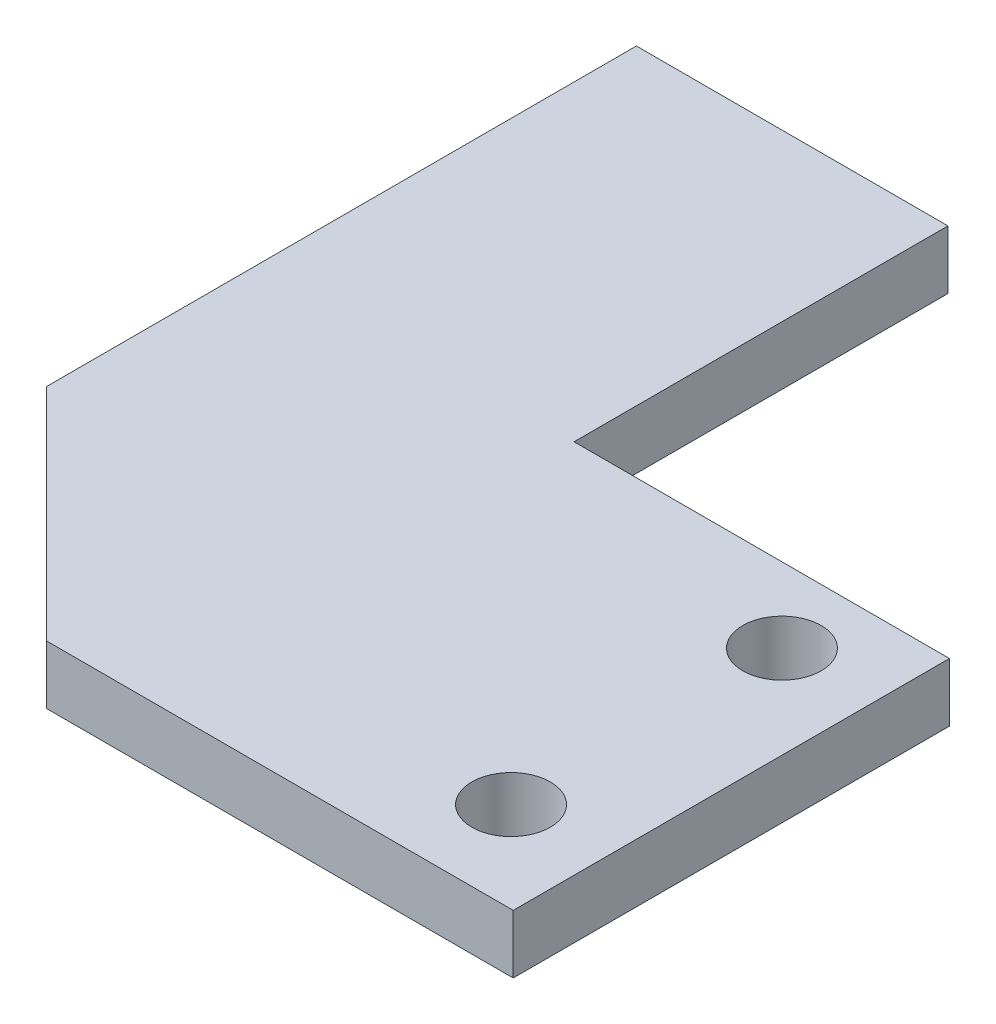
ISO-10303-21;
HEADER;
FILE_DESCRIPTION(('STEP AP214'),'2;1');
FILE_NAME('part.step','',(''),(''),'','','');
FILE_SCHEMA(('AUTOMOTIVE_DESIGN { 1 0 10303 214 1 1 1 1 }'));
ENDSEC;
DATA;
#1=APPLICATION_CONTEXT('core data for automotive mechanical design processes');
#2=APPLICATION_PROTOCOL_DEFINITION('international standard','automotive_design',2000,#1);
#3=PRODUCT_CONTEXT('',#1,'mechanical');
#4=PRODUCT('Part','Part','',(#3));
#5=PRODUCT_RELATED_PRODUCT_CATEGORY('part','',(#4));
#6=PRODUCT_DEFINITION_FORMATION('','',#4);
#7=PRODUCT_DEFINITION_CONTEXT('part definition',#1,'design');
#8=PRODUCT_DEFINITION('design','',#6,#7);
#9=PRODUCT_DEFINITION_SHAPE('','',#8);
#10=(LENGTH_UNIT() NAMED_UNIT(*) SI_UNIT(.MILLI.,.METRE.));
#11=(NAMED_UNIT(*) PLANE_ANGLE_UNIT() SI_UNIT($,.RADIAN.));
#12=(NAMED_UNIT(*) SI_UNIT($,.STERADIAN.) SOLID_ANGLE_UNIT());
#13=UNCERTAINTY_MEASURE_WITH_UNIT(LENGTH_MEASURE(1.E-05),#10,'distance_accuracy_value','');
#14=(GEOMETRIC_REPRESENTATION_CONTEXT(3) GLOBAL_UNCERTAINTY_ASSIGNED_CONTEXT((#13)) GLOBAL_UNIT_ASSIGNED_CONTEXT((#10,
#11,#12)) REPRESENTATION_CONTEXT('',''));
#15=CARTESIAN_POINT('',(0.,0.,0.));
#16=DIRECTION('',(0.,0.,1.));
#17=DIRECTION('',(1.,0.,0.));
#18=AXIS2_PLACEMENT_3D('',#15,#16,#17);
#19=CARTESIAN_POINT('',(0.,5.969,0.));
#20=DIRECTION('',(0.,-1.,0.));
#21=DIRECTION('',(0.,0.,-1.));
#22=AXIS2_PLACEMENT_3D('',#19,#20,#21);
#23=PLANE('',#22);
#24=DIRECTION('',(0.,0.,1.));
#25=VECTOR('',#24,1.);
#26=CARTESIAN_POINT('',(0.,5.969,0.));
#27=LINE('',#26,#25);
#28=CARTESIAN_POINT('',(0.,5.969,-82.55));
#29=VERTEX_POINT('',#28);
#30=CARTESIAN_POINT('',(0.,5.969,-22.450640302673));
#31=VERTEX_POINT('',#30);
#32=EDGE_CURVE('E125',#29,#31,#27,.T.);
#33=ORIENTED_EDGE('',*,*,#32,.T.);
#34=DIRECTION('',(-0.707106781186544,0.,-0.707106781186551));
#35=VECTOR('',#34,1.);
#36=CARTESIAN_POINT('',(0.,5.969,-22.450640302673));
#37=LINE('',#36,#35);
#38=CARTESIAN_POINT('',(22.4506403026728,5.969,0.));
#39=VERTEX_POINT('',#38);
#40=EDGE_CURVE('E92',#39,#31,#37,.T.);
#41=ORIENTED_EDGE('',*,*,#40,.F.);
#42=DIRECTION('',(1.,0.,0.));
#43=VECTOR('',#42,1.);
#44=CARTESIAN_POINT('',(0.,5.969,0.));
#45=LINE('',#44,#43);
#46=CARTESIAN_POINT('',(70.,5.969,0.));
#47=VERTEX_POINT('',#46);
#48=EDGE_CURVE('E134',#39,#47,#45,.T.);
#49=ORIENTED_EDGE('',*,*,#48,.T.);
#50=DIRECTION('',(0.,0.,-1.));
#51=VECTOR('',#50,1.);
#52=CARTESIAN_POINT('',(70.,5.969,0.));
#53=LINE('',#52,#51);
#54=CARTESIAN_POINT('',(70.,5.969,-44.45));
#55=VERTEX_POINT('',#54);
#56=EDGE_CURVE('E132',#47,#55,#53,.T.);
#57=ORIENTED_EDGE('',*,*,#56,.T.);
#58=DIRECTION('',(-1.,0.,0.));
#59=VECTOR('',#58,1.);
#60=CARTESIAN_POINT('',(0.,5.969,-44.45));
#61=LINE('',#60,#59);
#62=CARTESIAN_POINT('',(31.75,5.969,-44.45));
#63=VERTEX_POINT('',#62);
#64=EDGE_CURVE('E119',#55,#63,#61,.T.);
#65=ORIENTED_EDGE('',*,*,#64,.T.);
#66=DIRECTION('',(0.,0.,-1.));
#67=VECTOR('',#66,1.);
#68=CARTESIAN_POINT('',(31.75,5.969,-44.45));
#69=LINE('',#68,#67);
#70=CARTESIAN_POINT('',(31.75,5.969,-82.55));
#71=VERTEX_POINT('',#70);
#72=EDGE_CURVE('E55',#63,#71,#69,.T.);
#73=ORIENTED_EDGE('',*,*,#72,.T.);
#74=DIRECTION('',(-1.,0.,0.));
#75=VECTOR('',#74,1.);
#76=CARTESIAN_POINT('',(0.,5.969,-82.55));
#77=LINE('',#76,#75);
#78=EDGE_CURVE('E153',#71,#29,#77,.T.);
#79=ORIENTED_EDGE('',*,*,#78,.T.);
#80=EDGE_LOOP('',(#33,#41,#49,#57,#65,#73,#79));
#81=FACE_BOUND('',#80,.T.);
#82=CARTESIAN_POINT('',(60.55391,5.969,-9.22609999999999));
#83=DIRECTION('',(0.,1.,0.));
#84=DIRECTION('',(0.,0.,1.));
#85=AXIS2_PLACEMENT_3D('',#82,#83,#84);
#86=CIRCLE('',#85,4.00000000000001);
#87=CARTESIAN_POINT('',(60.55391,5.969,-5.22609999999999));
#88=VERTEX_POINT('',#87);
#89=EDGE_CURVE('E111',#88,#88,#86,.T.);
#90=ORIENTED_EDGE('',*,*,#89,.F.);
#91=EDGE_LOOP('',(#90));
#92=FACE_BOUND('',#91,.T.);
#93=CARTESIAN_POINT('',(60.55391,5.969,-36.83));
#94=DIRECTION('',(0.,1.,0.));
#95=DIRECTION('',(0.,0.,1.));
#96=AXIS2_PLACEMENT_3D('',#93,#94,#95);
#97=CIRCLE('',#96,4.00000000000001);
#98=CARTESIAN_POINT('',(60.55391,5.969,-32.83));
#99=VERTEX_POINT('',#98);
#100=EDGE_CURVE('E140',#99,#99,#97,.T.);
#101=ORIENTED_EDGE('',*,*,#100,.F.);
#102=EDGE_LOOP('',(#101));
#103=FACE_BOUND('',#102,.T.);
#104=ADVANCED_FACE('F32',(#81,#92,#103),#23,.F.);
#105=CARTESIAN_POINT('',(0.,0.,0.));
#106=DIRECTION('',(0.,-1.,0.));
#107=DIRECTION('',(0.,0.,-1.));
#108=AXIS2_PLACEMENT_3D('',#105,#106,#107);
#109=PLANE('',#108);
#110=DIRECTION('',(-0.707106781186544,0.,-0.707106781186551));
#111=VECTOR('',#110,1.);
#112=CARTESIAN_POINT('',(0.,0.,-22.450640302673));
#113=LINE('',#112,#111);
#114=CARTESIAN_POINT('',(22.4506403026728,0.,0.));
#115=VERTEX_POINT('',#114);
#116=CARTESIAN_POINT('',(0.,0.,-22.450640302673));
#117=VERTEX_POINT('',#116);
#118=EDGE_CURVE('E47',#115,#117,#113,.T.);
#119=ORIENTED_EDGE('',*,*,#118,.T.);
#120=DIRECTION('',(0.,0.,1.));
#121=VECTOR('',#120,1.);
#122=CARTESIAN_POINT('',(0.,0.,0.));
#123=LINE('',#122,#121);
#124=CARTESIAN_POINT('',(0.,0.,-82.55));
#125=VERTEX_POINT('',#124);
#126=EDGE_CURVE('E103',#125,#117,#123,.T.);
#127=ORIENTED_EDGE('',*,*,#126,.F.);
#128=DIRECTION('',(-1.,0.,0.));
#129=VECTOR('',#128,1.);
#130=CARTESIAN_POINT('',(0.,0.,-82.55));
#131=LINE('',#130,#129);
#132=CARTESIAN_POINT('',(31.75,0.,-82.55));
#133=VERTEX_POINT('',#132);
#134=EDGE_CURVE('E150',#133,#125,#131,.T.);
#135=ORIENTED_EDGE('',*,*,#134,.F.);
#136=DIRECTION('',(0.,0.,-1.));
#137=VECTOR('',#136,1.);
#138=CARTESIAN_POINT('',(31.75,0.,-44.45));
#139=LINE('',#138,#137);
#140=CARTESIAN_POINT('',(31.75,0.,-44.45));
#141=VERTEX_POINT('',#140);
#142=EDGE_CURVE('E156',#141,#133,#139,.T.);
#143=ORIENTED_EDGE('',*,*,#142,.F.);
#144=DIRECTION('',(-1.,0.,0.));
#145=VECTOR('',#144,1.);
#146=CARTESIAN_POINT('',(0.,0.,-44.45));
#147=LINE('',#146,#145);
#148=CARTESIAN_POINT('',(70.,0.,-44.45));
#149=VERTEX_POINT('',#148);
#150=EDGE_CURVE('E123',#149,#141,#147,.T.);
#151=ORIENTED_EDGE('',*,*,#150,.F.);
#152=DIRECTION('',(0.,0.,-1.));
#153=VECTOR('',#152,1.);
#154=CARTESIAN_POINT('',(70.,0.,0.));
#155=LINE('',#154,#153);
#156=CARTESIAN_POINT('',(70.,0.,0.));
#157=VERTEX_POINT('',#156);
#158=EDGE_CURVE('E113',#157,#149,#155,.T.);
#159=ORIENTED_EDGE('',*,*,#158,.F.);
#160=DIRECTION('',(1.,0.,0.));
#161=VECTOR('',#160,1.);
#162=CARTESIAN_POINT('',(0.,0.,0.));
#163=LINE('',#162,#161);
#164=EDGE_CURVE('E106',#115,#157,#163,.T.);
#165=ORIENTED_EDGE('',*,*,#164,.F.);
#166=EDGE_LOOP('',(#119,#127,#135,#143,#151,#159,#165));
#167=FACE_BOUND('',#166,.T.);
#168=CARTESIAN_POINT('',(60.55391,0.,-9.22609999999999));
#169=DIRECTION('',(0.,1.,0.));
#170=DIRECTION('',(0.,0.,1.));
#171=AXIS2_PLACEMENT_3D('',#168,#169,#170);
#172=CIRCLE('',#171,4.00000000000001);
#173=CARTESIAN_POINT('',(60.55391,0.,-5.22609999999999));
#174=VERTEX_POINT('',#173);
#175=EDGE_CURVE('E116',#174,#174,#172,.T.);
#176=ORIENTED_EDGE('',*,*,#175,.T.);
#177=EDGE_LOOP('',(#176));
#178=FACE_BOUND('',#177,.T.);
#179=CARTESIAN_POINT('',(60.55391,0.,-36.83));
#180=DIRECTION('',(0.,1.,0.));
#181=DIRECTION('',(0.,0.,1.));
#182=AXIS2_PLACEMENT_3D('',#179,#180,#181);
#183=CIRCLE('',#182,4.00000000000001);
#184=CARTESIAN_POINT('',(60.55391,0.,-32.83));
#185=VERTEX_POINT('',#184);
#186=EDGE_CURVE('E142',#185,#185,#183,.T.);
#187=ORIENTED_EDGE('',*,*,#186,.T.);
#188=EDGE_LOOP('',(#187));
#189=FACE_BOUND('',#188,.T.);
#190=ADVANCED_FACE('F100',(#167,#178,#189),#109,.T.);
#191=CARTESIAN_POINT('',(0.,5.969,0.));
#192=DIRECTION('',(1.,0.,0.));
#193=DIRECTION('',(0.,0.,-1.));
#194=AXIS2_PLACEMENT_3D('',#191,#192,#193);
#195=PLANE('',#194);
#196=ORIENTED_EDGE('',*,*,#126,.T.);
#197=DIRECTION('',(0.,1.,0.));
#198=VECTOR('',#197,1.);
#199=CARTESIAN_POINT('',(0.,0.,-22.450640302673));
#200=LINE('',#199,#198);
#201=EDGE_CURVE('E89',#117,#31,#200,.T.);
#202=ORIENTED_EDGE('',*,*,#201,.T.);
#203=ORIENTED_EDGE('',*,*,#32,.F.);
#204=DIRECTION('',(0.,1.,0.));
#205=VECTOR('',#204,1.);
#206=CARTESIAN_POINT('',(0.,0.,-82.55));
#207=LINE('',#206,#205);
#208=EDGE_CURVE('E109',#125,#29,#207,.T.);
#209=ORIENTED_EDGE('',*,*,#208,.F.);
#210=EDGE_LOOP('',(#196,#202,#203,#209));
#211=FACE_BOUND('',#210,.T.);
#212=ADVANCED_FACE('F34',(#211),#195,.F.);
#213=CARTESIAN_POINT('',(0.,5.969,0.));
#214=DIRECTION('',(0.,0.,-1.));
#215=DIRECTION('',(-1.,0.,0.));
#216=AXIS2_PLACEMENT_3D('',#213,#214,#215);
#217=PLANE('',#216);
#218=ORIENTED_EDGE('',*,*,#48,.F.);
#219=DIRECTION('',(0.,1.,0.));
#220=VECTOR('',#219,1.);
#221=CARTESIAN_POINT('',(22.4506403026728,0.,0.));
#222=LINE('',#221,#220);
#223=EDGE_CURVE('E96',#115,#39,#222,.T.);
#224=ORIENTED_EDGE('',*,*,#223,.F.);
#225=ORIENTED_EDGE('',*,*,#164,.T.);
#226=DIRECTION('',(0.,-1.,0.));
#227=VECTOR('',#226,1.);
#228=CARTESIAN_POINT('',(70.,5.969,0.));
#229=LINE('',#228,#227);
#230=EDGE_CURVE('E11',#47,#157,#229,.T.);
#231=ORIENTED_EDGE('',*,*,#230,.F.);
#232=EDGE_LOOP('',(#218,#224,#225,#231));
#233=FACE_BOUND('',#232,.T.);
#234=ADVANCED_FACE('F166',(#233),#217,.F.);
#235=CARTESIAN_POINT('',(70.,5.969,0.));
#236=DIRECTION('',(-1.,0.,0.));
#237=DIRECTION('',(0.,0.,1.));
#238=AXIS2_PLACEMENT_3D('',#235,#236,#237);
#239=PLANE('',#238);
#240=ORIENTED_EDGE('',*,*,#158,.T.);
#241=DIRECTION('',(0.,-1.,0.));
#242=VECTOR('',#241,1.);
#243=CARTESIAN_POINT('',(70.,5.969,-44.45));
#244=LINE('',#243,#242);
#245=EDGE_CURVE('E40',#55,#149,#244,.T.);
#246=ORIENTED_EDGE('',*,*,#245,.F.);
#247=ORIENTED_EDGE('',*,*,#56,.F.);
#248=ORIENTED_EDGE('',*,*,#230,.T.);
#249=EDGE_LOOP('',(#240,#246,#247,#248));
#250=FACE_BOUND('',#249,.T.);
#251=ADVANCED_FACE('F168',(#250),#239,.F.);
#252=CARTESIAN_POINT('',(0.,5.969,-44.45));
#253=DIRECTION('',(0.,0.,1.));
#254=DIRECTION('',(1.,0.,0.));
#255=AXIS2_PLACEMENT_3D('',#252,#253,#254);
#256=PLANE('',#255);
#257=ORIENTED_EDGE('',*,*,#150,.T.);
#258=DIRECTION('',(0.,1.,0.));
#259=VECTOR('',#258,1.);
#260=CARTESIAN_POINT('',(31.75,0.,-44.45));
#261=LINE('',#260,#259);
#262=EDGE_CURVE('E147',#141,#63,#261,.T.);
#263=ORIENTED_EDGE('',*,*,#262,.T.);
#264=ORIENTED_EDGE('',*,*,#64,.F.);
#265=ORIENTED_EDGE('',*,*,#245,.T.);
#266=EDGE_LOOP('',(#257,#263,#264,#265));
#267=FACE_BOUND('',#266,.T.);
#268=ADVANCED_FACE('F169',(#267),#256,.F.);
#269=CARTESIAN_POINT('',(60.55391,5.969,-9.22609999999999));
#270=DIRECTION('',(0.,-1.,0.));
#271=DIRECTION('',(0.,0.,-1.));
#272=AXIS2_PLACEMENT_3D('',#269,#270,#271);
#273=CYLINDRICAL_SURFACE('',#272,4.00000000000001);
#274=ORIENTED_EDGE('',*,*,#89,.T.);
#275=EDGE_LOOP('',(#274));
#276=FACE_BOUND('',#275,.T.);
#277=ORIENTED_EDGE('',*,*,#175,.F.);
#278=EDGE_LOOP('',(#277));
#279=FACE_BOUND('',#278,.T.);
#280=ADVANCED_FACE('F183',(#276,#279),#273,.F.);
#281=CARTESIAN_POINT('',(60.55391,5.969,-36.83));
#282=DIRECTION('',(0.,-1.,0.));
#283=DIRECTION('',(0.,0.,-1.));
#284=AXIS2_PLACEMENT_3D('',#281,#282,#283);
#285=CYLINDRICAL_SURFACE('',#284,4.00000000000001);
#286=ORIENTED_EDGE('',*,*,#100,.T.);
#287=EDGE_LOOP('',(#286));
#288=FACE_BOUND('',#287,.T.);
#289=ORIENTED_EDGE('',*,*,#186,.F.);
#290=EDGE_LOOP('',(#289));
#291=FACE_BOUND('',#290,.T.);
#292=ADVANCED_FACE('F176',(#288,#291),#285,.F.);
#293=CARTESIAN_POINT('',(0.,0.,-82.55));
#294=DIRECTION('',(0.,0.,-1.));
#295=DIRECTION('',(-1.,0.,0.));
#296=AXIS2_PLACEMENT_3D('',#293,#294,#295);
#297=PLANE('',#296);
#298=ORIENTED_EDGE('',*,*,#78,.F.);
#299=DIRECTION('',(0.,1.,0.));
#300=VECTOR('',#299,1.);
#301=CARTESIAN_POINT('',(31.75,0.,-82.55));
#302=LINE('',#301,#300);
#303=EDGE_CURVE('E149',#133,#71,#302,.T.);
#304=ORIENTED_EDGE('',*,*,#303,.F.);
#305=ORIENTED_EDGE('',*,*,#134,.T.);
#306=ORIENTED_EDGE('',*,*,#208,.T.);
#307=EDGE_LOOP('',(#298,#304,#305,#306));
#308=FACE_BOUND('',#307,.T.);
#309=ADVANCED_FACE('F174',(#308),#297,.T.);
#310=CARTESIAN_POINT('',(31.75,0.,-44.45));
#311=DIRECTION('',(1.,0.,0.));
#312=DIRECTION('',(0.,0.,-1.));
#313=AXIS2_PLACEMENT_3D('',#310,#311,#312);
#314=PLANE('',#313);
#315=ORIENTED_EDGE('',*,*,#72,.F.);
#316=ORIENTED_EDGE('',*,*,#262,.F.);
#317=ORIENTED_EDGE('',*,*,#142,.T.);
#318=ORIENTED_EDGE('',*,*,#303,.T.);
#319=EDGE_LOOP('',(#315,#316,#317,#318));
#320=FACE_BOUND('',#319,.T.);
#321=ADVANCED_FACE('F171',(#320),#314,.T.);
#322=CARTESIAN_POINT('',(0.,0.,-22.450640302673));
#323=DIRECTION('',(0.707106781186551,0.,-0.707106781186544));
#324=DIRECTION('',(-0.707106781186544,0.,-0.707106781186551));
#325=AXIS2_PLACEMENT_3D('',#322,#323,#324);
#326=PLANE('',#325);
#327=ORIENTED_EDGE('',*,*,#40,.T.);
#328=ORIENTED_EDGE('',*,*,#201,.F.);
#329=ORIENTED_EDGE('',*,*,#118,.F.);
#330=ORIENTED_EDGE('',*,*,#223,.T.);
#331=EDGE_LOOP('',(#327,#328,#329,#330));
#332=FACE_BOUND('',#331,.T.);
#333=ADVANCED_FACE('F90',(#332),#326,.F.);
#334=CLOSED_SHELL('',(#104,#190,#212,#234,#251,#268,#280,#292,#309,#321,#333));
#335=MANIFOLD_SOLID_BREP('B2',#334);
#336=ADVANCED_BREP_SHAPE_REPRESENTATION('',(#18,#335),#14);
#337=SHAPE_DEFINITION_REPRESENTATION(#9,#336);
ENDSEC;
END-ISO-10303-21;
